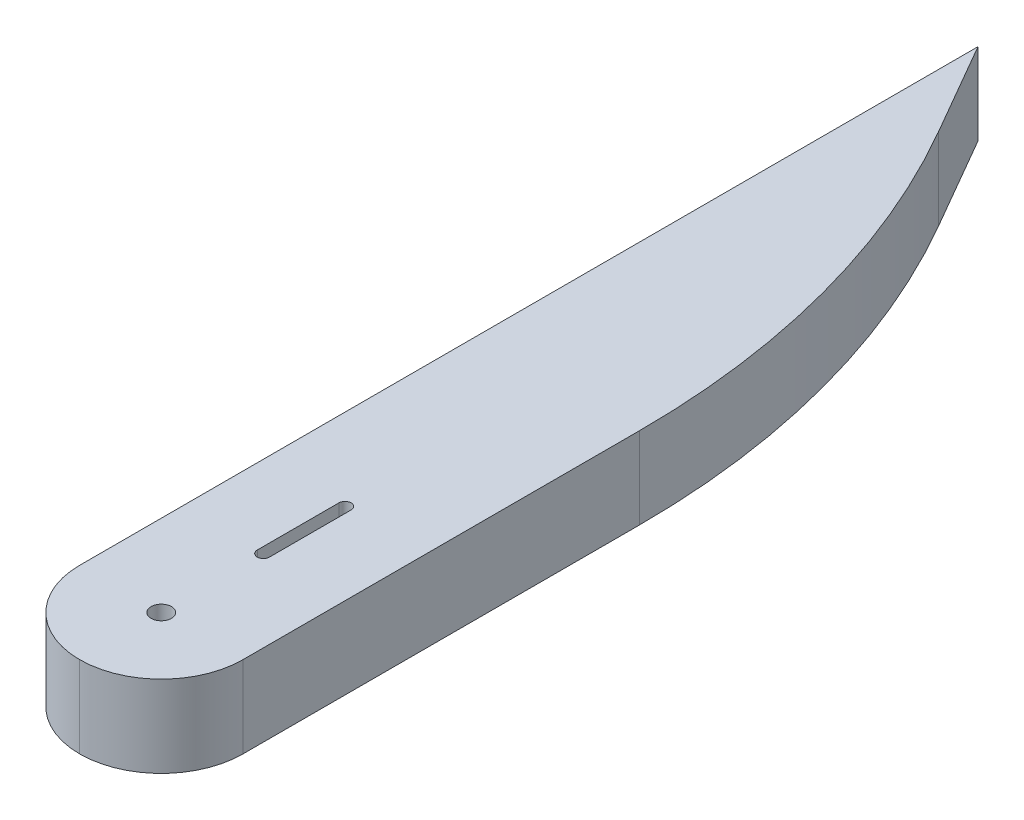
ISO-10303-21;
HEADER;
FILE_DESCRIPTION(('STEP AP214'),'2;1');
FILE_NAME('part.step','',(''),(''),'','','');
FILE_SCHEMA(('AUTOMOTIVE_DESIGN { 1 0 10303 214 1 1 1 1 }'));
ENDSEC;
DATA;
#1=APPLICATION_CONTEXT('core data for automotive mechanical design processes');
#2=APPLICATION_PROTOCOL_DEFINITION('international standard','automotive_design',2000,#1);
#3=PRODUCT_CONTEXT('',#1,'mechanical');
#4=PRODUCT('Part','Part','',(#3));
#5=PRODUCT_RELATED_PRODUCT_CATEGORY('part','',(#4));
#6=PRODUCT_DEFINITION_FORMATION('','',#4);
#7=PRODUCT_DEFINITION_CONTEXT('part definition',#1,'design');
#8=PRODUCT_DEFINITION('design','',#6,#7);
#9=PRODUCT_DEFINITION_SHAPE('','',#8);
#10=(LENGTH_UNIT() NAMED_UNIT(*) SI_UNIT(.MILLI.,.METRE.));
#11=(NAMED_UNIT(*) PLANE_ANGLE_UNIT() SI_UNIT($,.RADIAN.));
#12=(NAMED_UNIT(*) SI_UNIT($,.STERADIAN.) SOLID_ANGLE_UNIT());
#13=UNCERTAINTY_MEASURE_WITH_UNIT(LENGTH_MEASURE(1.E-05),#10,'distance_accuracy_value','');
#14=(GEOMETRIC_REPRESENTATION_CONTEXT(3) GLOBAL_UNCERTAINTY_ASSIGNED_CONTEXT((#13)) GLOBAL_UNIT_ASSIGNED_CONTEXT((#10,
#11,#12)) REPRESENTATION_CONTEXT('',''));
#15=CARTESIAN_POINT('',(0.,0.,0.));
#16=DIRECTION('',(0.,0.,1.));
#17=DIRECTION('',(1.,0.,0.));
#18=AXIS2_PLACEMENT_3D('',#15,#16,#17);
#19=CARTESIAN_POINT('',(0.,0.,304.8));
#20=DIRECTION('',(-1.,0.,0.));
#21=DIRECTION('',(0.,0.,1.));
#22=AXIS2_PLACEMENT_3D('',#19,#20,#21);
#23=PLANE('',#22);
#24=DIRECTION('',(0.,0.,-1.));
#25=VECTOR('',#24,1.);
#26=CARTESIAN_POINT('',(0.,0.,304.8));
#27=LINE('',#26,#25);
#28=CARTESIAN_POINT('',(0.,0.,279.4));
#29=VERTEX_POINT('',#28);
#30=CARTESIAN_POINT('',(0.,0.,156.047275902004));
#31=VERTEX_POINT('',#30);
#32=EDGE_CURVE('E184',#29,#31,#27,.T.);
#33=ORIENTED_EDGE('',*,*,#32,.T.);
#34=DIRECTION('',(0.,1.,0.));
#35=VECTOR('',#34,1.);
#36=CARTESIAN_POINT('',(0.,0.,156.047275902004));
#37=LINE('',#36,#35);
#38=CARTESIAN_POINT('',(0.,25.4,156.047275902004));
#39=VERTEX_POINT('',#38);
#40=EDGE_CURVE('E219',#31,#39,#37,.T.);
#41=ORIENTED_EDGE('',*,*,#40,.T.);
#42=DIRECTION('',(0.,0.,-1.));
#43=VECTOR('',#42,1.);
#44=CARTESIAN_POINT('',(0.,25.4,304.8));
#45=LINE('',#44,#43);
#46=CARTESIAN_POINT('',(0.,25.4,279.4));
#47=VERTEX_POINT('',#46);
#48=EDGE_CURVE('E196',#47,#39,#45,.T.);
#49=ORIENTED_EDGE('',*,*,#48,.F.);
#50=DIRECTION('',(0.,1.,0.));
#51=VECTOR('',#50,1.);
#52=CARTESIAN_POINT('',(0.,0.,279.4));
#53=LINE('',#52,#51);
#54=EDGE_CURVE('E206',#47,#29,#53,.F.);
#55=ORIENTED_EDGE('',*,*,#54,.T.);
#56=EDGE_LOOP('',(#33,#41,#49,#55));
#57=FACE_BOUND('',#56,.T.);
#58=ADVANCED_FACE('F38',(#57),#23,.F.);
#59=CARTESIAN_POINT('',(0.,25.4,304.8));
#60=DIRECTION('',(0.,-1.,0.));
#61=DIRECTION('',(1.,0.,0.));
#62=AXIS2_PLACEMENT_3D('',#59,#60,#61);
#63=PLANE('',#62);
#64=DIRECTION('',(0.,0.,-1.));
#65=VECTOR('',#64,1.);
#66=CARTESIAN_POINT('',(-23.495,25.4,247.65));
#67=LINE('',#66,#65);
#68=CARTESIAN_POINT('',(-23.495,25.4,247.65));
#69=VERTEX_POINT('',#68);
#70=CARTESIAN_POINT('',(-23.495,25.4,222.25));
#71=VERTEX_POINT('',#70);
#72=EDGE_CURVE('E149',#69,#71,#67,.T.);
#73=ORIENTED_EDGE('',*,*,#72,.F.);
#74=CARTESIAN_POINT('',(-25.4,25.4,247.65));
#75=DIRECTION('',(0.,1.,0.));
#76=DIRECTION('',(-1.,0.,0.));
#77=AXIS2_PLACEMENT_3D('',#74,#75,#76);
#78=CIRCLE('',#77,1.905);
#79=CARTESIAN_POINT('',(-27.305,25.4,247.65));
#80=VERTEX_POINT('',#79);
#81=EDGE_CURVE('E54',#80,#69,#78,.T.);
#82=ORIENTED_EDGE('',*,*,#81,.F.);
#83=DIRECTION('',(0.,0.,1.));
#84=VECTOR('',#83,1.);
#85=CARTESIAN_POINT('',(-27.305,25.4,247.65));
#86=LINE('',#85,#84);
#87=CARTESIAN_POINT('',(-27.305,25.4,222.25));
#88=VERTEX_POINT('',#87);
#89=EDGE_CURVE('E136',#88,#80,#86,.T.);
#90=ORIENTED_EDGE('',*,*,#89,.F.);
#91=CARTESIAN_POINT('',(-25.4,25.4,222.25));
#92=DIRECTION('',(0.,1.,0.));
#93=DIRECTION('',(-1.,0.,0.));
#94=AXIS2_PLACEMENT_3D('',#91,#92,#93);
#95=CIRCLE('',#94,1.905);
#96=EDGE_CURVE('E140',#71,#88,#95,.T.);
#97=ORIENTED_EDGE('',*,*,#96,.F.);
#98=EDGE_LOOP('',(#73,#82,#90,#97));
#99=FACE_BOUND('',#98,.T.);
#100=CARTESIAN_POINT('',(-25.4,25.4,279.4));
#101=DIRECTION('',(0.,1.,0.));
#102=DIRECTION('',(-1.,0.,0.));
#103=AXIS2_PLACEMENT_3D('',#100,#101,#102);
#104=CIRCLE('',#103,3.175);
#105=CARTESIAN_POINT('',(-28.575,25.4,279.4));
#106=VERTEX_POINT('',#105);
#107=EDGE_CURVE('E158',#106,#106,#104,.T.);
#108=ORIENTED_EDGE('',*,*,#107,.F.);
#109=EDGE_LOOP('',(#108));
#110=FACE_BOUND('',#109,.T.);
#111=ORIENTED_EDGE('',*,*,#48,.T.);
#112=CARTESIAN_POINT('',(-254.,25.4,156.047275902004));
#113=DIRECTION('',(0.,-1.,0.));
#114=DIRECTION('',(1.,0.,0.));
#115=AXIS2_PLACEMENT_3D('',#112,#113,#114);
#116=CIRCLE('',#115,254.);
#117=CARTESIAN_POINT('',(-34.0295474387531,25.4,29.0472759020029));
#118=VERTEX_POINT('',#117);
#119=EDGE_CURVE('E226',#39,#118,#116,.F.);
#120=ORIENTED_EDGE('',*,*,#119,.T.);
#121=DIRECTION('',(0.500000000000004,0.,0.866025403784436));
#122=VECTOR('',#121,1.);
#123=CARTESIAN_POINT('',(-50.8,25.4,0.));
#124=LINE('',#123,#122);
#125=CARTESIAN_POINT('',(-50.8,25.4,0.));
#126=VERTEX_POINT('',#125);
#127=EDGE_CURVE('E168',#126,#118,#124,.T.);
#128=ORIENTED_EDGE('',*,*,#127,.F.);
#129=DIRECTION('',(0.,0.,-1.));
#130=VECTOR('',#129,1.);
#131=CARTESIAN_POINT('',(-50.8,25.4,304.8));
#132=LINE('',#131,#130);
#133=CARTESIAN_POINT('',(-50.8,25.4,279.4));
#134=VERTEX_POINT('',#133);
#135=EDGE_CURVE('E192',#134,#126,#132,.T.);
#136=ORIENTED_EDGE('',*,*,#135,.F.);
#137=CARTESIAN_POINT('',(-25.4,25.4,279.4));
#138=DIRECTION('',(0.,-1.,0.));
#139=DIRECTION('',(1.,0.,0.));
#140=AXIS2_PLACEMENT_3D('',#137,#138,#139);
#141=CIRCLE('',#140,25.4);
#142=CARTESIAN_POINT('',(-25.4,25.4,304.8));
#143=VERTEX_POINT('',#142);
#144=EDGE_CURVE('E200',#134,#143,#141,.F.);
#145=ORIENTED_EDGE('',*,*,#144,.T.);
#146=CARTESIAN_POINT('',(-25.4,25.4,279.4));
#147=DIRECTION('',(0.,-1.,0.));
#148=DIRECTION('',(1.,0.,0.));
#149=AXIS2_PLACEMENT_3D('',#146,#147,#148);
#150=CIRCLE('',#149,25.4);
#151=EDGE_CURVE('E203',#143,#47,#150,.F.);
#152=ORIENTED_EDGE('',*,*,#151,.T.);
#153=EDGE_LOOP('',(#111,#120,#128,#136,#145,#152));
#154=FACE_BOUND('',#153,.T.);
#155=ADVANCED_FACE('F243',(#99,#110,#154),#63,.F.);
#156=CARTESIAN_POINT('',(-50.8,0.,304.8));
#157=DIRECTION('',(1.,0.,0.));
#158=DIRECTION('',(0.,0.,-1.));
#159=AXIS2_PLACEMENT_3D('',#156,#157,#158);
#160=PLANE('',#159);
#161=DIRECTION('',(0.,0.,-1.));
#162=VECTOR('',#161,1.);
#163=CARTESIAN_POINT('',(-50.8,0.,304.8));
#164=LINE('',#163,#162);
#165=CARTESIAN_POINT('',(-50.8,0.,279.4));
#166=VERTEX_POINT('',#165);
#167=CARTESIAN_POINT('',(-50.8,0.,0.));
#168=VERTEX_POINT('',#167);
#169=EDGE_CURVE('E188',#166,#168,#164,.T.);
#170=ORIENTED_EDGE('',*,*,#169,.F.);
#171=DIRECTION('',(0.,-1.,0.));
#172=VECTOR('',#171,1.);
#173=CARTESIAN_POINT('',(-50.8,25.4,279.4));
#174=LINE('',#173,#172);
#175=EDGE_CURVE('E216',#166,#134,#174,.F.);
#176=ORIENTED_EDGE('',*,*,#175,.T.);
#177=ORIENTED_EDGE('',*,*,#135,.T.);
#178=DIRECTION('',(0.,-1.,0.));
#179=VECTOR('',#178,1.);
#180=CARTESIAN_POINT('',(-50.8,0.,0.));
#181=LINE('',#180,#179);
#182=EDGE_CURVE('E180',#126,#168,#181,.T.);
#183=ORIENTED_EDGE('',*,*,#182,.T.);
#184=EDGE_LOOP('',(#170,#176,#177,#183));
#185=FACE_BOUND('',#184,.T.);
#186=ADVANCED_FACE('F255',(#185),#160,.F.);
#187=CARTESIAN_POINT('',(0.,0.,304.8));
#188=DIRECTION('',(0.,1.,0.));
#189=DIRECTION('',(0.,0.,1.));
#190=AXIS2_PLACEMENT_3D('',#187,#188,#189);
#191=PLANE('',#190);
#192=DIRECTION('',(0.,0.,1.));
#193=VECTOR('',#192,1.);
#194=CARTESIAN_POINT('',(-27.305,0.,247.65));
#195=LINE('',#194,#193);
#196=CARTESIAN_POINT('',(-27.305,0.,222.25));
#197=VERTEX_POINT('',#196);
#198=CARTESIAN_POINT('',(-27.305,0.,247.65));
#199=VERTEX_POINT('',#198);
#200=EDGE_CURVE('E124',#197,#199,#195,.T.);
#201=ORIENTED_EDGE('',*,*,#200,.T.);
#202=CARTESIAN_POINT('',(-25.4,0.,247.65));
#203=DIRECTION('',(0.,1.,0.));
#204=DIRECTION('',(-1.,0.,0.));
#205=AXIS2_PLACEMENT_3D('',#202,#203,#204);
#206=CIRCLE('',#205,1.905);
#207=CARTESIAN_POINT('',(-23.495,0.,247.65));
#208=VERTEX_POINT('',#207);
#209=EDGE_CURVE('E117',#199,#208,#206,.T.);
#210=ORIENTED_EDGE('',*,*,#209,.T.);
#211=DIRECTION('',(0.,0.,-1.));
#212=VECTOR('',#211,1.);
#213=CARTESIAN_POINT('',(-23.495,0.,247.65));
#214=LINE('',#213,#212);
#215=CARTESIAN_POINT('',(-23.495,0.,222.25));
#216=VERTEX_POINT('',#215);
#217=EDGE_CURVE('E127',#208,#216,#214,.T.);
#218=ORIENTED_EDGE('',*,*,#217,.T.);
#219=CARTESIAN_POINT('',(-25.4,0.,222.25));
#220=DIRECTION('',(0.,1.,0.));
#221=DIRECTION('',(-1.,0.,0.));
#222=AXIS2_PLACEMENT_3D('',#219,#220,#221);
#223=CIRCLE('',#222,1.905);
#224=EDGE_CURVE('E62',#216,#197,#223,.T.);
#225=ORIENTED_EDGE('',*,*,#224,.T.);
#226=EDGE_LOOP('',(#201,#210,#218,#225));
#227=FACE_BOUND('',#226,.T.);
#228=CARTESIAN_POINT('',(-25.4,0.,279.4));
#229=DIRECTION('',(0.,1.,0.));
#230=DIRECTION('',(-1.,0.,0.));
#231=AXIS2_PLACEMENT_3D('',#228,#229,#230);
#232=CIRCLE('',#231,3.175);
#233=CARTESIAN_POINT('',(-28.575,0.,279.4));
#234=VERTEX_POINT('',#233);
#235=EDGE_CURVE('E164',#234,#234,#232,.T.);
#236=ORIENTED_EDGE('',*,*,#235,.T.);
#237=EDGE_LOOP('',(#236));
#238=FACE_BOUND('',#237,.T.);
#239=DIRECTION('',(0.500000000000004,0.,0.866025403784436));
#240=VECTOR('',#239,1.);
#241=CARTESIAN_POINT('',(-50.8,0.,0.));
#242=LINE('',#241,#240);
#243=CARTESIAN_POINT('',(-34.0295474387531,0.,29.0472759020029));
#244=VERTEX_POINT('',#243);
#245=EDGE_CURVE('E172',#168,#244,#242,.T.);
#246=ORIENTED_EDGE('',*,*,#245,.T.);
#247=CARTESIAN_POINT('',(-254.,0.,156.047275902004));
#248=DIRECTION('',(0.,1.,0.));
#249=DIRECTION('',(0.,0.,1.));
#250=AXIS2_PLACEMENT_3D('',#247,#248,#249);
#251=CIRCLE('',#250,254.);
#252=EDGE_CURVE('E11',#244,#31,#251,.F.);
#253=ORIENTED_EDGE('',*,*,#252,.T.);
#254=ORIENTED_EDGE('',*,*,#32,.F.);
#255=CARTESIAN_POINT('',(-25.4,0.,279.4));
#256=DIRECTION('',(0.,1.,0.));
#257=DIRECTION('',(0.,0.,1.));
#258=AXIS2_PLACEMENT_3D('',#255,#256,#257);
#259=CIRCLE('',#258,25.4);
#260=CARTESIAN_POINT('',(-25.4,0.,304.8));
#261=VERTEX_POINT('',#260);
#262=EDGE_CURVE('E213',#29,#261,#259,.F.);
#263=ORIENTED_EDGE('',*,*,#262,.T.);
#264=CARTESIAN_POINT('',(-25.4,0.,279.4));
#265=DIRECTION('',(0.,1.,0.));
#266=DIRECTION('',(0.,0.,1.));
#267=AXIS2_PLACEMENT_3D('',#264,#265,#266);
#268=CIRCLE('',#267,25.4);
#269=EDGE_CURVE('E210',#261,#166,#268,.F.);
#270=ORIENTED_EDGE('',*,*,#269,.T.);
#271=ORIENTED_EDGE('',*,*,#169,.T.);
#272=EDGE_LOOP('',(#246,#253,#254,#263,#270,#271));
#273=FACE_BOUND('',#272,.T.);
#274=ADVANCED_FACE('F132',(#227,#238,#273),#191,.F.);
#275=CARTESIAN_POINT('',(-25.4,0.,279.4));
#276=DIRECTION('',(0.,1.,0.));
#277=DIRECTION('',(0.,0.,1.));
#278=AXIS2_PLACEMENT_3D('',#275,#276,#277);
#279=CYLINDRICAL_SURFACE('',#278,25.4);
#280=ORIENTED_EDGE('',*,*,#175,.F.);
#281=ORIENTED_EDGE('',*,*,#269,.F.);
#282=DIRECTION('',(0.,-1.,0.));
#283=VECTOR('',#282,1.);
#284=CARTESIAN_POINT('',(-25.4,0.,304.8));
#285=LINE('',#284,#283);
#286=EDGE_CURVE('E176',#143,#261,#285,.T.);
#287=ORIENTED_EDGE('',*,*,#286,.F.);
#288=ORIENTED_EDGE('',*,*,#144,.F.);
#289=EDGE_LOOP('',(#280,#281,#287,#288));
#290=FACE_BOUND('',#289,.T.);
#291=ADVANCED_FACE('F253',(#290),#279,.T.);
#292=CARTESIAN_POINT('',(-25.4,0.,279.4));
#293=DIRECTION('',(0.,-1.,0.));
#294=DIRECTION('',(0.,0.,-1.));
#295=AXIS2_PLACEMENT_3D('',#292,#293,#294);
#296=CYLINDRICAL_SURFACE('',#295,25.4);
#297=ORIENTED_EDGE('',*,*,#262,.F.);
#298=ORIENTED_EDGE('',*,*,#54,.F.);
#299=ORIENTED_EDGE('',*,*,#151,.F.);
#300=ORIENTED_EDGE('',*,*,#286,.T.);
#301=EDGE_LOOP('',(#297,#298,#299,#300));
#302=FACE_BOUND('',#301,.T.);
#303=ADVANCED_FACE('F249',(#302),#296,.T.);
#304=CARTESIAN_POINT('',(-50.8,0.,0.));
#305=DIRECTION('',(-0.866025403784436,0.,0.500000000000004));
#306=DIRECTION('',(0.500000000000004,0.,0.866025403784436));
#307=AXIS2_PLACEMENT_3D('',#304,#305,#306);
#308=PLANE('',#307);
#309=ORIENTED_EDGE('',*,*,#127,.T.);
#310=DIRECTION('',(0.,1.,0.));
#311=VECTOR('',#310,1.);
#312=CARTESIAN_POINT('',(-34.0295474387531,0.,29.0472759020029));
#313=LINE('',#312,#311);
#314=EDGE_CURVE('E47',#118,#244,#313,.F.);
#315=ORIENTED_EDGE('',*,*,#314,.T.);
#316=ORIENTED_EDGE('',*,*,#245,.F.);
#317=ORIENTED_EDGE('',*,*,#182,.F.);
#318=EDGE_LOOP('',(#309,#315,#316,#317));
#319=FACE_BOUND('',#318,.T.);
#320=ADVANCED_FACE('F231',(#319),#308,.F.);
#321=CARTESIAN_POINT('',(-254.,0.,156.047275902004));
#322=DIRECTION('',(0.,1.,0.));
#323=DIRECTION('',(0.,0.,1.));
#324=AXIS2_PLACEMENT_3D('',#321,#322,#323);
#325=CYLINDRICAL_SURFACE('',#324,254.);
#326=ORIENTED_EDGE('',*,*,#252,.F.);
#327=ORIENTED_EDGE('',*,*,#314,.F.);
#328=ORIENTED_EDGE('',*,*,#119,.F.);
#329=ORIENTED_EDGE('',*,*,#40,.F.);
#330=EDGE_LOOP('',(#326,#327,#328,#329));
#331=FACE_BOUND('',#330,.T.);
#332=ADVANCED_FACE('F40',(#331),#325,.T.);
#333=CARTESIAN_POINT('',(-25.4,0.,279.4));
#334=DIRECTION('',(0.,1.,0.));
#335=DIRECTION('',(-1.,0.,0.));
#336=AXIS2_PLACEMENT_3D('',#333,#334,#335);
#337=CYLINDRICAL_SURFACE('',#336,3.175);
#338=CARTESIAN_POINT('',(-28.575,0.,279.4));
#339=CARTESIAN_POINT('',(-28.575,0.264583333333326,279.4));
#340=CARTESIAN_POINT('',(-28.575,0.529166666666659,279.4));
#341=CARTESIAN_POINT('',(-28.575,1.05833333333333,279.4));
#342=CARTESIAN_POINT('',(-28.575,1.32291666666666,279.4));
#343=CARTESIAN_POINT('',(-28.575,1.85208333333333,279.4));
#344=CARTESIAN_POINT('',(-28.575,2.11666666666666,279.4));
#345=CARTESIAN_POINT('',(-28.575,2.64583333333333,279.4));
#346=CARTESIAN_POINT('',(-28.575,2.91041666666666,279.4));
#347=CARTESIAN_POINT('',(-28.575,3.43958333333333,279.4));
#348=CARTESIAN_POINT('',(-28.575,3.70416666666666,279.4));
#349=CARTESIAN_POINT('',(-28.575,4.23333333333333,279.4));
#350=CARTESIAN_POINT('',(-28.575,4.49791666666666,279.4));
#351=CARTESIAN_POINT('',(-28.575,5.02708333333333,279.4));
#352=CARTESIAN_POINT('',(-28.575,5.29166666666666,279.4));
#353=CARTESIAN_POINT('',(-28.575,5.82083333333333,279.4));
#354=CARTESIAN_POINT('',(-28.575,6.08541666666666,279.4));
#355=CARTESIAN_POINT('',(-28.575,6.61458333333333,279.4));
#356=CARTESIAN_POINT('',(-28.575,6.87916666666666,279.4));
#357=CARTESIAN_POINT('',(-28.575,7.40833333333333,279.4));
#358=CARTESIAN_POINT('',(-28.575,7.67291666666666,279.4));
#359=CARTESIAN_POINT('',(-28.575,8.20208333333333,279.4));
#360=CARTESIAN_POINT('',(-28.575,8.46666666666666,279.4));
#361=CARTESIAN_POINT('',(-28.575,8.99583333333333,279.4));
#362=CARTESIAN_POINT('',(-28.575,9.26041666666666,279.4));
#363=CARTESIAN_POINT('',(-28.575,9.78958333333333,279.4));
#364=CARTESIAN_POINT('',(-28.575,10.0541666666667,279.4));
#365=CARTESIAN_POINT('',(-28.575,10.5833333333333,279.4));
#366=CARTESIAN_POINT('',(-28.575,10.8479166666667,279.4));
#367=CARTESIAN_POINT('',(-28.575,11.3770833333333,279.4));
#368=CARTESIAN_POINT('',(-28.575,11.6416666666667,279.4));
#369=CARTESIAN_POINT('',(-28.575,12.1708333333333,279.4));
#370=CARTESIAN_POINT('',(-28.575,12.4354166666667,279.4));
#371=CARTESIAN_POINT('',(-28.575,12.9645833333333,279.4));
#372=CARTESIAN_POINT('',(-28.575,13.2291666666667,279.4));
#373=CARTESIAN_POINT('',(-28.575,13.7583333333333,279.4));
#374=CARTESIAN_POINT('',(-28.575,14.0229166666667,279.4));
#375=CARTESIAN_POINT('',(-28.575,14.5520833333333,279.4));
#376=CARTESIAN_POINT('',(-28.575,14.8166666666667,279.4));
#377=CARTESIAN_POINT('',(-28.575,15.3458333333333,279.4));
#378=CARTESIAN_POINT('',(-28.575,15.6104166666667,279.4));
#379=CARTESIAN_POINT('',(-28.575,16.1395833333333,279.4));
#380=CARTESIAN_POINT('',(-28.575,16.4041666666667,279.4));
#381=CARTESIAN_POINT('',(-28.575,16.9333333333333,279.4));
#382=CARTESIAN_POINT('',(-28.575,17.1979166666667,279.4));
#383=CARTESIAN_POINT('',(-28.575,17.7270833333333,279.4));
#384=CARTESIAN_POINT('',(-28.575,17.9916666666667,279.4));
#385=CARTESIAN_POINT('',(-28.575,18.5208333333333,279.4));
#386=CARTESIAN_POINT('',(-28.575,18.7854166666667,279.4));
#387=CARTESIAN_POINT('',(-28.575,19.3145833333333,279.4));
#388=CARTESIAN_POINT('',(-28.575,19.5791666666667,279.4));
#389=CARTESIAN_POINT('',(-28.575,20.1083333333333,279.4));
#390=CARTESIAN_POINT('',(-28.575,20.3729166666667,279.4));
#391=CARTESIAN_POINT('',(-28.575,20.9020833333333,279.4));
#392=CARTESIAN_POINT('',(-28.575,21.1666666666667,279.4));
#393=CARTESIAN_POINT('',(-28.575,21.6958333333333,279.4));
#394=CARTESIAN_POINT('',(-28.575,21.9604166666667,279.4));
#395=CARTESIAN_POINT('',(-28.575,22.4895833333333,279.4));
#396=CARTESIAN_POINT('',(-28.575,22.7541666666667,279.4));
#397=CARTESIAN_POINT('',(-28.575,23.2833333333333,279.4));
#398=CARTESIAN_POINT('',(-28.575,23.5479166666667,279.4));
#399=CARTESIAN_POINT('',(-28.575,24.0770833333333,279.4));
#400=CARTESIAN_POINT('',(-28.575,24.3416666666667,279.4));
#401=CARTESIAN_POINT('',(-28.575,24.8708333333333,279.4));
#402=CARTESIAN_POINT('',(-28.575,25.1354166666667,279.4));
#403=CARTESIAN_POINT('',(-28.575,25.4,279.4));
#404=B_SPLINE_CURVE_WITH_KNOTS('',3,(#338,#339,#340,#341,#342,#343,#344,#345,#346,#347,#348,
#349,#350,#351,#352,#353,#354,#355,#356,#357,#358,#359,#360,#361,#362,#363,#364,#365,#366,#367,
#368,#369,#370,#371,#372,#373,#374,#375,#376,#377,#378,#379,#380,#381,#382,#383,#384,#385,#386,
#387,#388,#389,#390,#391,#392,#393,#394,#395,#396,#397,#398,#399,#400,#401,#402,#403),
.UNSPECIFIED.,.F.,.F.,(4,2,2,2,2,2,2,2,2,2,2,2,2,2,2,2,2,2,2,2,2,2,2,2,2,2,2,2,2,2,2,2,4),(0.,
0.79375,1.5875,2.38125,3.175,3.96875,4.7625,5.55625,6.35,7.14375,7.9375,8.73125,9.525,10.31875,
11.1125,11.90625,12.7,13.49375,14.2875,15.08125,15.875,16.66875,17.4625,18.25625,19.05,19.84375,
20.6375,21.43125,22.225,23.01875,23.8125,24.60625,25.4),.UNSPECIFIED.);
#405=EDGE_CURVE('BSEAM293',#234,#106,#404,.T.);
#406=ORIENTED_EDGE('',*,*,#235,.F.);
#407=ORIENTED_EDGE('',*,*,#107,.T.);
#408=ORIENTED_EDGE('',*,*,#405,.T.);
#409=ORIENTED_EDGE('',*,*,#405,.F.);
#410=EDGE_LOOP('',(#406,#408,#407,#409));
#411=FACE_BOUND('',#410,.T.);
#412=ADVANCED_FACE('F293',(#411),#337,.F.);
#413=CARTESIAN_POINT('',(-25.4,0.,247.65));
#414=DIRECTION('',(0.,1.,0.));
#415=DIRECTION('',(-1.,0.,0.));
#416=AXIS2_PLACEMENT_3D('',#413,#414,#415);
#417=CYLINDRICAL_SURFACE('',#416,1.905);
#418=ORIENTED_EDGE('',*,*,#81,.T.);
#419=DIRECTION('',(0.,1.,0.));
#420=VECTOR('',#419,1.);
#421=CARTESIAN_POINT('',(-23.495,0.,247.65));
#422=LINE('',#421,#420);
#423=EDGE_CURVE('E113',#208,#69,#422,.T.);
#424=ORIENTED_EDGE('',*,*,#423,.F.);
#425=ORIENTED_EDGE('',*,*,#209,.F.);
#426=DIRECTION('',(0.,1.,0.));
#427=VECTOR('',#426,1.);
#428=CARTESIAN_POINT('',(-27.305,0.,247.65));
#429=LINE('',#428,#427);
#430=EDGE_CURVE('E155',#199,#80,#429,.T.);
#431=ORIENTED_EDGE('',*,*,#430,.T.);
#432=EDGE_LOOP('',(#418,#424,#425,#431));
#433=FACE_BOUND('',#432,.T.);
#434=ADVANCED_FACE('F115',(#433),#417,.F.);
#435=CARTESIAN_POINT('',(-27.305,0.,247.65));
#436=DIRECTION('',(-1.,0.,0.));
#437=DIRECTION('',(0.,-1.,0.));
#438=AXIS2_PLACEMENT_3D('',#435,#436,#437);
#439=PLANE('',#438);
#440=ORIENTED_EDGE('',*,*,#89,.T.);
#441=ORIENTED_EDGE('',*,*,#430,.F.);
#442=ORIENTED_EDGE('',*,*,#200,.F.);
#443=DIRECTION('',(0.,1.,0.));
#444=VECTOR('',#443,1.);
#445=CARTESIAN_POINT('',(-27.305,0.,222.25));
#446=LINE('',#445,#444);
#447=EDGE_CURVE('E159',#197,#88,#446,.T.);
#448=ORIENTED_EDGE('',*,*,#447,.T.);
#449=EDGE_LOOP('',(#440,#441,#442,#448));
#450=FACE_BOUND('',#449,.T.);
#451=ADVANCED_FACE('F306',(#450),#439,.F.);
#452=CARTESIAN_POINT('',(-25.4,0.,222.25));
#453=DIRECTION('',(0.,1.,0.));
#454=DIRECTION('',(-1.,0.,0.));
#455=AXIS2_PLACEMENT_3D('',#452,#453,#454);
#456=CYLINDRICAL_SURFACE('',#455,1.905);
#457=ORIENTED_EDGE('',*,*,#96,.T.);
#458=ORIENTED_EDGE('',*,*,#447,.F.);
#459=ORIENTED_EDGE('',*,*,#224,.F.);
#460=DIRECTION('',(0.,1.,0.));
#461=VECTOR('',#460,1.);
#462=CARTESIAN_POINT('',(-23.495,0.,222.25));
#463=LINE('',#462,#461);
#464=EDGE_CURVE('E123',#216,#71,#463,.T.);
#465=ORIENTED_EDGE('',*,*,#464,.T.);
#466=EDGE_LOOP('',(#457,#458,#459,#465));
#467=FACE_BOUND('',#466,.T.);
#468=ADVANCED_FACE('F313',(#467),#456,.F.);
#469=CARTESIAN_POINT('',(-23.495,0.,247.65));
#470=DIRECTION('',(1.,0.,0.));
#471=DIRECTION('',(0.,1.,0.));
#472=AXIS2_PLACEMENT_3D('',#469,#470,#471);
#473=PLANE('',#472);
#474=ORIENTED_EDGE('',*,*,#72,.T.);
#475=ORIENTED_EDGE('',*,*,#464,.F.);
#476=ORIENTED_EDGE('',*,*,#217,.F.);
#477=ORIENTED_EDGE('',*,*,#423,.T.);
#478=EDGE_LOOP('',(#474,#475,#476,#477));
#479=FACE_BOUND('',#478,.T.);
#480=ADVANCED_FACE('F128',(#479),#473,.F.);
#481=CLOSED_SHELL('',(#58,#155,#186,#274,#291,#303,#320,#332,#412,#434,#451,#468,#480));
#482=MANIFOLD_SOLID_BREP('B2',#481);
#483=ADVANCED_BREP_SHAPE_REPRESENTATION('',(#18,#482),#14);
#484=SHAPE_DEFINITION_REPRESENTATION(#9,#483);
ENDSEC;
END-ISO-10303-21;
